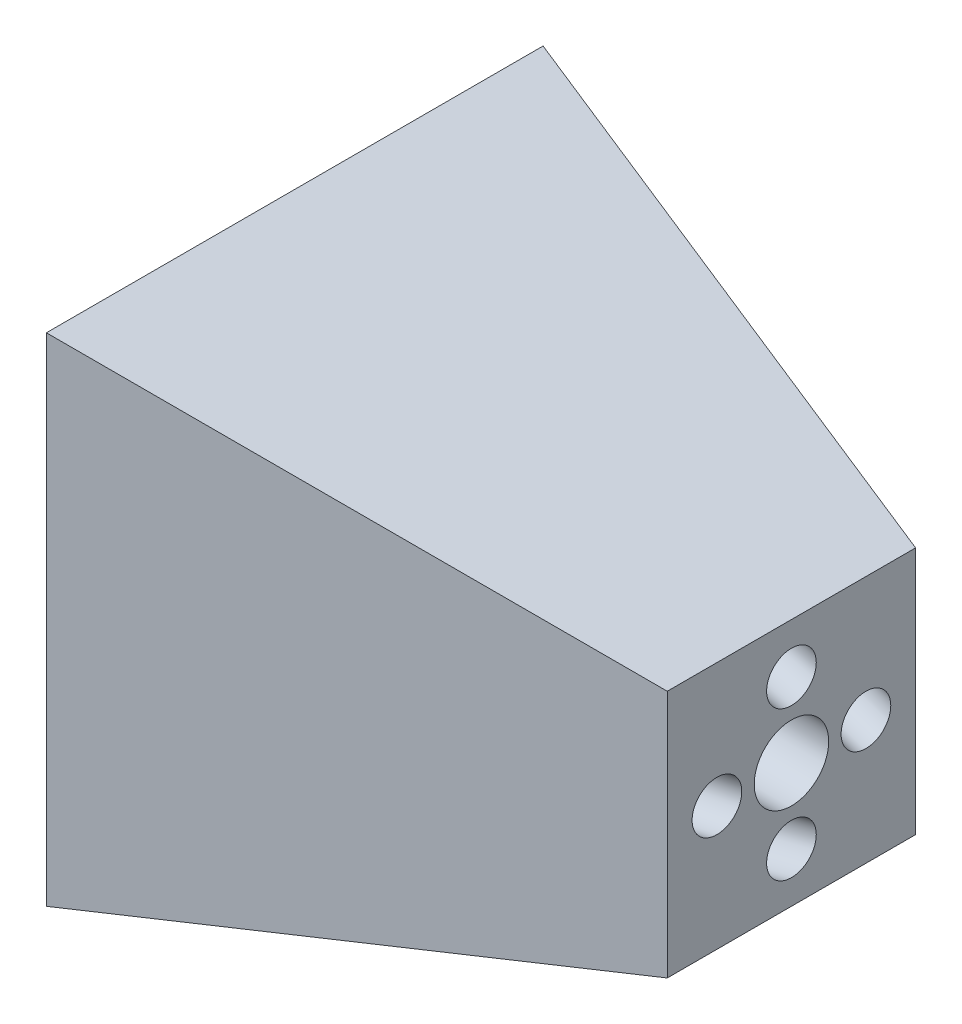
ISO-10303-21;
HEADER;
FILE_DESCRIPTION(('STEP AP214'),'2;1');
FILE_NAME('part.step','',(''),(''),'','','');
FILE_SCHEMA(('AUTOMOTIVE_DESIGN { 1 0 10303 214 1 1 1 1 }'));
ENDSEC;
DATA;
#1=APPLICATION_CONTEXT('core data for automotive mechanical design processes');
#2=APPLICATION_PROTOCOL_DEFINITION('international standard','automotive_design',2000,#1);
#3=PRODUCT_CONTEXT('',#1,'mechanical');
#4=PRODUCT('Part','Part','',(#3));
#5=PRODUCT_RELATED_PRODUCT_CATEGORY('part','',(#4));
#6=PRODUCT_DEFINITION_FORMATION('','',#4);
#7=PRODUCT_DEFINITION_CONTEXT('part definition',#1,'design');
#8=PRODUCT_DEFINITION('design','',#6,#7);
#9=PRODUCT_DEFINITION_SHAPE('','',#8);
#10=(LENGTH_UNIT() NAMED_UNIT(*) SI_UNIT(.MILLI.,.METRE.));
#11=(NAMED_UNIT(*) PLANE_ANGLE_UNIT() SI_UNIT($,.RADIAN.));
#12=(NAMED_UNIT(*) SI_UNIT($,.STERADIAN.) SOLID_ANGLE_UNIT());
#13=UNCERTAINTY_MEASURE_WITH_UNIT(LENGTH_MEASURE(1.E-05),#10,'distance_accuracy_value','');
#14=(GEOMETRIC_REPRESENTATION_CONTEXT(3) GLOBAL_UNCERTAINTY_ASSIGNED_CONTEXT((#13)) GLOBAL_UNIT_ASSIGNED_CONTEXT((#10,
#11,#12)) REPRESENTATION_CONTEXT('',''));
#15=CARTESIAN_POINT('',(0.,0.,0.));
#16=DIRECTION('',(0.,0.,1.));
#17=DIRECTION('',(1.,0.,0.));
#18=AXIS2_PLACEMENT_3D('',#15,#16,#17);
#19=CARTESIAN_POINT('',(-100.,0.,0.));
#20=DIRECTION('',(-1.,0.,0.));
#21=DIRECTION('',(0.,0.,1.));
#22=AXIS2_PLACEMENT_3D('',#19,#20,#21);
#23=PLANE('',#22);
#24=CARTESIAN_POINT('',(-100.,0.,0.));
#25=DIRECTION('',(-1.,0.,0.));
#26=DIRECTION('',(0.,0.,1.));
#27=AXIS2_PLACEMENT_3D('',#24,#25,#26);
#28=CIRCLE('',#27,7.5);
#29=CARTESIAN_POINT('',(-100.,0.,7.5));
#30=VERTEX_POINT('',#29);
#31=EDGE_CURVE('E260',#30,#30,#28,.T.);
#32=ORIENTED_EDGE('',*,*,#31,.F.);
#33=EDGE_LOOP('',(#32));
#34=FACE_BOUND('',#33,.T.);
#35=CARTESIAN_POINT('',(-100.,0.,45.));
#36=CARTESIAN_POINT('',(-100.,0.1385285597722,45.0000003298171));
#37=CARTESIAN_POINT('',(-100.,0.277059840437409,44.9942395939713));
#38=CARTESIAN_POINT('',(-100.,0.553216965321283,44.9712328197263));
#39=CARTESIAN_POINT('',(-100.,0.690842445484033,44.9539824179015));
#40=CARTESIAN_POINT('',(-100.,0.964134984880488,44.9081192702555));
#41=CARTESIAN_POINT('',(-100.,1.09980274929102,44.8795107271996));
#42=CARTESIAN_POINT('',(-100.,1.36834298276902,44.8111165305056));
#43=CARTESIAN_POINT('',(-100.,1.50121442896931,44.7713268607555));
#44=CARTESIAN_POINT('',(-100.,1.76314651576361,44.6808658808765));
#45=CARTESIAN_POINT('',(-100.,1.89220850790448,44.6301984841238));
#46=CARTESIAN_POINT('',(-100.,2.14572590134345,44.5183033445398));
#47=CARTESIAN_POINT('',(-100.,2.27017963256983,44.4570718178089));
#48=CARTESIAN_POINT('',(-100.,2.51352792657697,44.3245078801161));
#49=CARTESIAN_POINT('',(-100.,2.63242446784617,44.2531791010129));
#50=CARTESIAN_POINT('',(-100.,2.86392672172824,44.1008692351718));
#51=CARTESIAN_POINT('',(-100.,2.97653016135156,44.0198846935648));
#52=CARTESIAN_POINT('',(-100.,3.19458281353073,43.8488740810885));
#53=CARTESIAN_POINT('',(-100.,3.30003457819729,43.7588512643216));
#54=CARTESIAN_POINT('',(-100.,3.50313654992574,43.5703275849029));
#55=CARTESIAN_POINT('',(-100.,3.60078394357853,43.4718236912399));
#56=CARTESIAN_POINT('',(-100.,3.78752676708732,43.2670831077228));
#57=CARTESIAN_POINT('',(-100.,3.87662525240749,43.1608492047004));
#58=CARTESIAN_POINT('',(-100.,4.04572511418824,42.9413114512762));
#59=CARTESIAN_POINT('',(-100.,4.12572321439969,42.8280050772916));
#60=CARTESIAN_POINT('',(-100.,4.27600558810493,42.5951815442083));
#61=CARTESIAN_POINT('',(-100.,4.34629333615365,42.4756666278215));
#62=CARTESIAN_POINT('',(-100.,4.47672708609251,42.2311699564561));
#63=CARTESIAN_POINT('',(-100.,4.53686943925657,42.1061862549297));
#64=CARTESIAN_POINT('',(-100.,4.64654636397008,41.8517013366476));
#65=CARTESIAN_POINT('',(-100.,4.69608473333763,41.7222017566435));
#66=CARTESIAN_POINT('',(-100.,4.78425485840752,41.4594898104109));
#67=CARTESIAN_POINT('',(-100.,4.82288269356029,41.3262761284153));
#68=CARTESIAN_POINT('',(-100.,4.88892903017654,41.0571485181558));
#69=CARTESIAN_POINT('',(-100.,4.91635154803485,40.9212355757545));
#70=CARTESIAN_POINT('',(-100.,4.95982657169531,40.6475555997026));
#71=CARTESIAN_POINT('',(-100.,4.97587499349174,40.5097879181601));
#72=CARTESIAN_POINT('',(-100.,4.99646769365315,40.2334356954907));
#73=CARTESIAN_POINT('',(-100.,5.00101609708246,40.0948514651446));
#74=CARTESIAN_POINT('',(-100.,4.99860214578275,39.8177699306864));
#75=CARTESIAN_POINT('',(-100.,4.99163565948307,39.6792726756193));
#76=CARTESIAN_POINT('',(-100.,4.953482728418,39.2654535252476));
#77=CARTESIAN_POINT('',(-100.,4.90506430050006,38.9915124524441));
#78=CARTESIAN_POINT('',(-100.,4.76357583058781,38.4555680393227));
#79=CARTESIAN_POINT('',(-100.,4.6705057885935,38.1935646990047));
#80=CARTESIAN_POINT('',(-100.,4.44228191414584,37.6885353161968));
#81=CARTESIAN_POINT('',(-100.,4.3071280816925,37.4455092737069));
#82=CARTESIAN_POINT('',(-100.,3.99846413140332,36.9851875392002));
#83=CARTESIAN_POINT('',(-100.,3.8249540135675,36.7678918471833));
#84=CARTESIAN_POINT('',(-100.,3.44436319647969,36.3650107092301));
#85=CARTESIAN_POINT('',(-100.,3.2372824972277,36.1794252632938));
#86=CARTESIAN_POINT('',(-100.,2.79526206835773,35.8450869106089));
#87=CARTESIAN_POINT('',(-100.,2.56032233873975,35.6963340038603));
#88=CARTESIAN_POINT('',(-100.,2.06906381021707,35.4397625736148));
#89=CARTESIAN_POINT('',(-100.,1.81274501131237,35.3319440501178));
#90=CARTESIAN_POINT('',(-100.,1.28579796366704,35.1602154257565));
#91=CARTESIAN_POINT('',(-100.,1.01516971492641,35.0963053248923));
#92=CARTESIAN_POINT('',(-100.,0.467068062566414,35.0141562040276));
#93=CARTESIAN_POINT('',(-100.,0.189594658947038,34.9959171840271));
#94=CARTESIAN_POINT('',(-100.,-0.364544209932403,35.0056133003614));
#95=CARTESIAN_POINT('',(-100.,-0.641209675192468,35.0335484366962));
#96=CARTESIAN_POINT('',(-100.,-1.1861018580487,35.1348223717362));
#97=CARTESIAN_POINT('',(-100.,-1.45432857564486,35.2081611704414));
#98=CARTESIAN_POINT('',(-100.,-1.97494520601803,35.3982196478799));
#99=CARTESIAN_POINT('',(-100.,-2.22733511879504,35.5149393266133));
#100=CARTESIAN_POINT('',(-100.,-2.70931688295291,35.7885402764901));
#101=CARTESIAN_POINT('',(-100.,-2.93890873433376,35.9454215476336));
#102=CARTESIAN_POINT('',(-100.,-3.36896192062001,36.2950186839018));
#103=CARTESIAN_POINT('',(-100.,-3.56942325552539,36.4877345490264));
#104=CARTESIAN_POINT('',(-100.,-3.93568641299084,36.903685507934));
#105=CARTESIAN_POINT('',(-100.,-4.10148823555089,37.1269206017169));
#106=CARTESIAN_POINT('',(-100.,-4.39385932887062,37.597752890883));
#107=CARTESIAN_POINT('',(-100.,-4.52042859963029,37.8453500862661));
#108=CARTESIAN_POINT('',(-100.,-4.73084363698725,38.3580775116862));
#109=CARTESIAN_POINT('',(-100.,-4.81468940358454,38.623207741723));
#110=CARTESIAN_POINT('',(-100.,-4.9373448524081,39.163688584712));
#111=CARTESIAN_POINT('',(-100.,-4.97615453463437,39.4390391976641));
#112=CARTESIAN_POINT('',(-100.,-5.00766739131246,39.9923662622781));
#113=CARTESIAN_POINT('',(-100.,-5.00037056576426,40.27034271394));
#114=CARTESIAN_POINT('',(-100.,-4.93987166197812,40.821254489156));
#115=CARTESIAN_POINT('',(-100.,-4.88666958374018,41.0941898127101));
#116=CARTESIAN_POINT('',(-100.,-4.73582756490299,41.6274914001349));
#117=CARTESIAN_POINT('',(-100.,-4.63818762430375,41.8878576640056));
#118=CARTESIAN_POINT('',(-100.,-4.40116290516972,42.3888398943105));
#119=CARTESIAN_POINT('',(-100.,-4.26177812663492,42.6294558607447));
#120=CARTESIAN_POINT('',(-100.,-3.94510821935056,43.0843009160244));
#121=CARTESIAN_POINT('',(-100.,-3.767823090601,43.2985300048699));
#122=CARTESIAN_POINT('',(-100.,-3.38024200036282,43.6946928183599));
#123=CARTESIAN_POINT('',(-100.,-3.16994603887421,43.8766265430045));
#124=CARTESIAN_POINT('',(-100.,-2.72214445377665,44.2031797434365));
#125=CARTESIAN_POINT('',(-100.,-2.4846388301677,44.347799219224));
#126=CARTESIAN_POINT('',(-100.,-1.98896520609138,44.5957384995294));
#127=CARTESIAN_POINT('',(-100.,-1.730797205624,44.6990583040472));
#128=CARTESIAN_POINT('',(-100.,-1.23138937391074,44.8521965812932));
#129=CARTESIAN_POINT('',(-100.,-0.991615447864816,44.9068001624824));
#130=CARTESIAN_POINT('',(-100.,-0.625689194239185,44.9622760170203));
#131=CARTESIAN_POINT('',(-100.,-0.501414470705697,44.9763662784638));
#132=CARTESIAN_POINT('',(-100.,-0.25143000604386,44.9952547298808));
#133=CARTESIAN_POINT('',(-100.,-0.125716123452094,44.9999997006874));
#134=CARTESIAN_POINT('',(-100.,0.,45.));
#135=B_SPLINE_CURVE_WITH_KNOTS('',3,(#35,#36,#37,#38,#39,#40,#41,#42,#43,#44,#45,#46,#47,#48,
#49,#50,#51,#52,#53,#54,#55,#56,#57,#58,#59,#60,#61,#62,#63,#64,#65,#66,#67,#68,#69,#70,#71,#72,
#73,#74,#75,#76,#77,#78,#79,#80,#81,#82,#83,#84,#85,#86,#87,#88,#89,#90,#91,#92,#93,#94,#95,#96,
#97,#98,#99,#100,#101,#102,#103,#104,#105,#106,#107,#108,#109,#110,#111,#112,#113,#114,#115,
#116,#117,#118,#119,#120,#121,#122,#123,#124,#125,#126,#127,#128,#129,#130,#131,#132,#133,#134),
.UNSPECIFIED.,.T.,.F.,(4,2,2,2,2,2,2,2,2,2,2,2,2,2,2,2,2,2,2,2,2,2,2,2,2,2,2,2,2,2,2,2,2,2,2,2,
2,2,2,2,2,2,2,2,2,2,2,2,2,4),(0.,0.415470913561703,0.831099700376821,1.24657483840776,
1.66219940075635,2.07767468763347,2.49329910113596,2.90877439766641,3.32439880151559,
3.73987409870046,4.15549850189521,4.57097379912329,4.98659820227484,5.40207349950566,
5.81769790265447,6.23317319988544,6.64879760303409,7.06427290026508,7.4798973034137,
7.89537260064469,8.31099700379332,9.14137881569243,9.97176062759153,10.8021424394906,
11.6325242513897,12.4629060632888,13.2932878751879,14.1236696870871,14.9540514989862,
15.7844333108853,16.6148151227844,17.4451969346835,18.2755787465826,19.1059605584817,
19.9363423703808,20.7667241822799,21.597105994179,22.4274878060781,23.2578696179772,
24.0882514298763,24.9186332417754,25.7490150536745,26.5793968655736,27.4097786774727,
28.2401604893718,29.0705423012709,29.90092411317,30.6358438530342,31.0107591240888,
31.3878033433167),.UNSPECIFIED.);
#136=CARTESIAN_POINT('',(-100.,0.,45.));
#137=VERTEX_POINT('',#136);
#138=EDGE_CURVE('E264',#137,#137,#135,.T.);
#139=ORIENTED_EDGE('',*,*,#138,.F.);
#140=EDGE_LOOP('',(#139));
#141=FACE_BOUND('',#140,.T.);
#142=CARTESIAN_POINT('',(-100.,40.,-5.));
#143=CARTESIAN_POINT('',(-100.,40.1385285597722,-5.00000032981713));
#144=CARTESIAN_POINT('',(-100.,40.2770598404374,-4.99423959397131));
#145=CARTESIAN_POINT('',(-100.,40.5532169653212,-4.9712328197264));
#146=CARTESIAN_POINT('',(-100.,40.690842445484,-4.95398241790152));
#147=CARTESIAN_POINT('',(-100.,40.9641349848805,-4.90811927025559));
#148=CARTESIAN_POINT('',(-100.,41.099802749291,-4.87951072719967));
#149=CARTESIAN_POINT('',(-100.,41.368342982769,-4.81111653050566));
#150=CARTESIAN_POINT('',(-100.,41.5012144289693,-4.77132686075554));
#151=CARTESIAN_POINT('',(-100.,41.7631465157636,-4.68086588087654));
#152=CARTESIAN_POINT('',(-100.,41.8922085079044,-4.63019848412386));
#153=CARTESIAN_POINT('',(-100.,42.1457259013434,-4.51830334453983));
#154=CARTESIAN_POINT('',(-100.,42.2701796325698,-4.45707181780894));
#155=CARTESIAN_POINT('',(-100.,42.5135279265769,-4.32450788011614));
#156=CARTESIAN_POINT('',(-100.,42.6324244678461,-4.25317910101296));
#157=CARTESIAN_POINT('',(-100.,42.8639267217282,-4.10086923517187));
#158=CARTESIAN_POINT('',(-100.,42.9765301613515,-4.01988469356488));
#159=CARTESIAN_POINT('',(-100.,43.1945828135307,-3.8488740810886));
#160=CARTESIAN_POINT('',(-100.,43.3000345781973,-3.75885126432164));
#161=CARTESIAN_POINT('',(-100.,43.5031365499257,-3.57032758490301));
#162=CARTESIAN_POINT('',(-100.,43.6007839435785,-3.47182369123994));
#163=CARTESIAN_POINT('',(-100.,43.7875267670873,-3.26708310772287));
#164=CARTESIAN_POINT('',(-100.,43.8766252524075,-3.16084920470046));
#165=CARTESIAN_POINT('',(-100.,44.0457251141882,-2.94131145127629));
#166=CARTESIAN_POINT('',(-100.,44.1257232143996,-2.82800507729169));
#167=CARTESIAN_POINT('',(-100.,44.2760055881049,-2.59518154420832));
#168=CARTESIAN_POINT('',(-100.,44.3462933361536,-2.47566662782151));
#169=CARTESIAN_POINT('',(-100.,44.4767270860925,-2.23116995645621));
#170=CARTESIAN_POINT('',(-100.,44.5368694392565,-2.10618625492972));
#171=CARTESIAN_POINT('',(-100.,44.6465463639701,-1.85170133664761));
#172=CARTESIAN_POINT('',(-100.,44.6960847333376,-1.72220175664351));
#173=CARTESIAN_POINT('',(-100.,44.7842548584075,-1.45948981041093));
#174=CARTESIAN_POINT('',(-100.,44.8228826935603,-1.32627612841536));
#175=CARTESIAN_POINT('',(-100.,44.8889290301765,-1.05714851815584));
#176=CARTESIAN_POINT('',(-100.,44.9163515480348,-0.921235575754509));
#177=CARTESIAN_POINT('',(-100.,44.9598265716953,-0.647555599702657));
#178=CARTESIAN_POINT('',(-100.,44.9758749934917,-0.509787918160154));
#179=CARTESIAN_POINT('',(-100.,44.9964676936531,-0.233435695490788));
#180=CARTESIAN_POINT('',(-100.,45.0010160970824,-0.0948514651446767));
#181=CARTESIAN_POINT('',(-100.,44.9986021457827,0.182230069313564));
#182=CARTESIAN_POINT('',(-100.,44.991635659483,0.320727324380607));
#183=CARTESIAN_POINT('',(-100.,44.953482728418,0.734546474752395));
#184=CARTESIAN_POINT('',(-100.,44.9050643005,1.00848754755585));
#185=CARTESIAN_POINT('',(-100.,44.7635758305878,1.54443196067729));
#186=CARTESIAN_POINT('',(-100.,44.6705057885935,1.80643530099526));
#187=CARTESIAN_POINT('',(-100.,44.4422819141458,2.31146468380314));
#188=CARTESIAN_POINT('',(-100.,44.3071280816925,2.55449072629304));
#189=CARTESIAN_POINT('',(-100.,43.9984641314033,3.01481246079979));
#190=CARTESIAN_POINT('',(-100.,43.8249540135675,3.23210815281664));
#191=CARTESIAN_POINT('',(-100.,43.4443631964797,3.63498929076985));
#192=CARTESIAN_POINT('',(-100.,43.2372824972277,3.8205747367062));
#193=CARTESIAN_POINT('',(-100.,42.7952620683577,4.15491308939109));
#194=CARTESIAN_POINT('',(-100.,42.5603223387397,4.30366599613963));
#195=CARTESIAN_POINT('',(-100.,42.069063810217,4.56023742638518));
#196=CARTESIAN_POINT('',(-100.,41.8127450113123,4.6680559498822));
#197=CARTESIAN_POINT('',(-100.,41.285797963667,4.83978457424346));
#198=CARTESIAN_POINT('',(-100.,41.0151697149264,4.90369467510771));
#199=CARTESIAN_POINT('',(-100.,40.4670680625664,4.9858437959724));
#200=CARTESIAN_POINT('',(-100.,40.189594658947,5.00408281597285));
#201=CARTESIAN_POINT('',(-100.,39.6354557900676,4.99438669963854));
#202=CARTESIAN_POINT('',(-100.,39.3587903248075,4.96645156330379));
#203=CARTESIAN_POINT('',(-100.,38.8138981419513,4.8651776282638));
#204=CARTESIAN_POINT('',(-100.,38.5456714243551,4.79183882955856));
#205=CARTESIAN_POINT('',(-100.,38.0250547939819,4.60178035212001));
#206=CARTESIAN_POINT('',(-100.,37.7726648812049,4.4850606733867));
#207=CARTESIAN_POINT('',(-100.,37.290683117047,4.21145972350986));
#208=CARTESIAN_POINT('',(-100.,37.0610912656662,4.05457845236633));
#209=CARTESIAN_POINT('',(-100.,36.6310380793799,3.70498131609816));
#210=CARTESIAN_POINT('',(-100.,36.4305767444746,3.51226545097352));
#211=CARTESIAN_POINT('',(-100.,36.0643135870091,3.09631449206596));
#212=CARTESIAN_POINT('',(-100.,35.8985117644491,2.87307939828305));
#213=CARTESIAN_POINT('',(-100.,35.6061406711293,2.40224710911697));
#214=CARTESIAN_POINT('',(-100.,35.4795714003697,2.1546499137338));
#215=CARTESIAN_POINT('',(-100.,35.2691563630127,1.64192248831377));
#216=CARTESIAN_POINT('',(-100.,35.1853105964154,1.3767922582769));
#217=CARTESIAN_POINT('',(-100.,35.0626551475919,0.836311415287918));
#218=CARTESIAN_POINT('',(-100.,35.0238454653656,0.560960802335802));
#219=CARTESIAN_POINT('',(-100.,34.9923326086875,0.00763373772181723));
#220=CARTESIAN_POINT('',(-100.,34.9996294342357,-0.270342713940052));
#221=CARTESIAN_POINT('',(-100.,35.0601283380218,-0.821254489156051));
#222=CARTESIAN_POINT('',(-100.,35.1133304162598,-1.09418981271018));
#223=CARTESIAN_POINT('',(-100.,35.264172435097,-1.62749140013499));
#224=CARTESIAN_POINT('',(-100.,35.3618123756962,-1.88785766400568));
#225=CARTESIAN_POINT('',(-100.,35.5988370948303,-2.3888398943106));
#226=CARTESIAN_POINT('',(-100.,35.7382218733651,-2.62945586074483));
#227=CARTESIAN_POINT('',(-100.,36.0548917806494,-3.08430091602454));
#228=CARTESIAN_POINT('',(-100.,36.232176909399,-3.29853000487001));
#229=CARTESIAN_POINT('',(-100.,36.6197579996372,-3.69469281836002));
#230=CARTESIAN_POINT('',(-100.,36.8300539611258,-3.87662654300457));
#231=CARTESIAN_POINT('',(-100.,37.2778555462234,-4.20317974343661));
#232=CARTESIAN_POINT('',(-100.,37.5153611698323,-4.34779921922412));
#233=CARTESIAN_POINT('',(-100.,38.0110347939087,-4.59573849952943));
#234=CARTESIAN_POINT('',(-100.,38.269202794376,-4.69905830404724));
#235=CARTESIAN_POINT('',(-100.,38.7686106260893,-4.8521965812933));
#236=CARTESIAN_POINT('',(-100.,39.0083845521352,-4.90680016248247));
#237=CARTESIAN_POINT('',(-100.,39.3743108057608,-4.96227601702033));
#238=CARTESIAN_POINT('',(-100.,39.4985855292943,-4.97636627846384));
#239=CARTESIAN_POINT('',(-100.,39.7485699939561,-4.99525472988085));
#240=CARTESIAN_POINT('',(-100.,39.8742838765479,-4.99999970068749));
#241=CARTESIAN_POINT('',(-100.,40.,-5.));
#242=B_SPLINE_CURVE_WITH_KNOTS('',3,(#142,#143,#144,#145,#146,#147,#148,#149,#150,#151,#152,
#153,#154,#155,#156,#157,#158,#159,#160,#161,#162,#163,#164,#165,#166,#167,#168,#169,#170,#171,
#172,#173,#174,#175,#176,#177,#178,#179,#180,#181,#182,#183,#184,#185,#186,#187,#188,#189,#190,
#191,#192,#193,#194,#195,#196,#197,#198,#199,#200,#201,#202,#203,#204,#205,#206,#207,#208,#209,
#210,#211,#212,#213,#214,#215,#216,#217,#218,#219,#220,#221,#222,#223,#224,#225,#226,#227,#228,
#229,#230,#231,#232,#233,#234,#235,#236,#237,#238,#239,#240,#241),.UNSPECIFIED.,.T.,.F.,(4,2,2,
2,2,2,2,2,2,2,2,2,2,2,2,2,2,2,2,2,2,2,2,2,2,2,2,2,2,2,2,2,2,2,2,2,2,2,2,2,2,2,2,2,2,2,2,2,2,4),
(0.,0.415470913561702,0.831099700376814,1.24657483840776,1.66219940075633,2.07767468763346,
2.49329910113595,2.9087743976664,3.32439880151558,3.73987409870045,4.15549850189521,
4.57097379912328,4.98659820227483,5.40207349950565,5.81769790265446,6.23317319988543,
6.64879760303408,7.06427290026507,7.4798973034137,7.89537260064469,8.31099700379332,
9.14137881569243,9.97176062759154,10.8021424394906,11.6325242513898,12.4629060632889,
13.293287875188,14.1236696870871,14.9540514989862,15.7844333108853,16.6148151227844,
17.4451969346835,18.2755787465826,19.1059605584817,19.9363423703808,20.7667241822799,
21.597105994179,22.4274878060781,23.2578696179773,24.0882514298764,24.9186332417755,
25.7490150536746,26.5793968655737,27.4097786774728,28.2401604893719,29.070542301271,
29.9009241131701,30.6358438530342,31.0107591240888,31.3878033433167),.UNSPECIFIED.);
#243=CARTESIAN_POINT('',(-100.,40.,-5.));
#244=VERTEX_POINT('',#243);
#245=EDGE_CURVE('E268',#244,#244,#242,.T.);
#246=ORIENTED_EDGE('',*,*,#245,.T.);
#247=EDGE_LOOP('',(#246));
#248=FACE_BOUND('',#247,.T.);
#249=CARTESIAN_POINT('',(-100.,0.,-45.));
#250=CARTESIAN_POINT('',(-100.,0.1385285597722,-45.0000003298171));
#251=CARTESIAN_POINT('',(-100.,0.277059840437409,-44.9942395939713));
#252=CARTESIAN_POINT('',(-100.,0.553216965321283,-44.9712328197263));
#253=CARTESIAN_POINT('',(-100.,0.690842445484033,-44.9539824179015));
#254=CARTESIAN_POINT('',(-100.,0.964134984880488,-44.9081192702555));
#255=CARTESIAN_POINT('',(-100.,1.09980274929102,-44.8795107271996));
#256=CARTESIAN_POINT('',(-100.,1.36834298276902,-44.8111165305056));
#257=CARTESIAN_POINT('',(-100.,1.50121442896931,-44.7713268607555));
#258=CARTESIAN_POINT('',(-100.,1.76314651576361,-44.6808658808765));
#259=CARTESIAN_POINT('',(-100.,1.89220850790448,-44.6301984841238));
#260=CARTESIAN_POINT('',(-100.,2.14572590134345,-44.5183033445398));
#261=CARTESIAN_POINT('',(-100.,2.27017963256983,-44.4570718178089));
#262=CARTESIAN_POINT('',(-100.,2.51352792657697,-44.3245078801161));
#263=CARTESIAN_POINT('',(-100.,2.63242446784617,-44.2531791010129));
#264=CARTESIAN_POINT('',(-100.,2.86392672172824,-44.1008692351718));
#265=CARTESIAN_POINT('',(-100.,2.97653016135156,-44.0198846935648));
#266=CARTESIAN_POINT('',(-100.,3.19458281353073,-43.8488740810885));
#267=CARTESIAN_POINT('',(-100.,3.30003457819729,-43.7588512643216));
#268=CARTESIAN_POINT('',(-100.,3.50313654992574,-43.5703275849029));
#269=CARTESIAN_POINT('',(-100.,3.60078394357853,-43.4718236912399));
#270=CARTESIAN_POINT('',(-100.,3.78752676708732,-43.2670831077228));
#271=CARTESIAN_POINT('',(-100.,3.87662525240749,-43.1608492047004));
#272=CARTESIAN_POINT('',(-100.,4.04572511418824,-42.9413114512762));
#273=CARTESIAN_POINT('',(-100.,4.12572321439969,-42.8280050772916));
#274=CARTESIAN_POINT('',(-100.,4.27600558810493,-42.5951815442083));
#275=CARTESIAN_POINT('',(-100.,4.34629333615365,-42.4756666278215));
#276=CARTESIAN_POINT('',(-100.,4.47672708609251,-42.2311699564561));
#277=CARTESIAN_POINT('',(-100.,4.53686943925657,-42.1061862549297));
#278=CARTESIAN_POINT('',(-100.,4.64654636397008,-41.8517013366476));
#279=CARTESIAN_POINT('',(-100.,4.69608473333763,-41.7222017566435));
#280=CARTESIAN_POINT('',(-100.,4.78425485840752,-41.4594898104109));
#281=CARTESIAN_POINT('',(-100.,4.82288269356029,-41.3262761284153));
#282=CARTESIAN_POINT('',(-100.,4.88892903017654,-41.0571485181558));
#283=CARTESIAN_POINT('',(-100.,4.91635154803485,-40.9212355757545));
#284=CARTESIAN_POINT('',(-100.,4.95982657169531,-40.6475555997026));
#285=CARTESIAN_POINT('',(-100.,4.97587499349174,-40.5097879181601));
#286=CARTESIAN_POINT('',(-100.,4.99646769365315,-40.2334356954907));
#287=CARTESIAN_POINT('',(-100.,5.00101609708246,-40.0948514651446));
#288=CARTESIAN_POINT('',(-100.,4.99860214578275,-39.8177699306864));
#289=CARTESIAN_POINT('',(-100.,4.99163565948307,-39.6792726756193));
#290=CARTESIAN_POINT('',(-100.,4.953482728418,-39.2654535252476));
#291=CARTESIAN_POINT('',(-100.,4.90506430050006,-38.9915124524441));
#292=CARTESIAN_POINT('',(-100.,4.76357583058781,-38.4555680393227));
#293=CARTESIAN_POINT('',(-100.,4.6705057885935,-38.1935646990047));
#294=CARTESIAN_POINT('',(-100.,4.44228191414584,-37.6885353161968));
#295=CARTESIAN_POINT('',(-100.,4.3071280816925,-37.4455092737069));
#296=CARTESIAN_POINT('',(-100.,3.99846413140332,-36.9851875392002));
#297=CARTESIAN_POINT('',(-100.,3.8249540135675,-36.7678918471833));
#298=CARTESIAN_POINT('',(-100.,3.44436319647969,-36.3650107092301));
#299=CARTESIAN_POINT('',(-100.,3.2372824972277,-36.1794252632938));
#300=CARTESIAN_POINT('',(-100.,2.79526206835773,-35.8450869106089));
#301=CARTESIAN_POINT('',(-100.,2.56032233873975,-35.6963340038603));
#302=CARTESIAN_POINT('',(-100.,2.06906381021707,-35.4397625736148));
#303=CARTESIAN_POINT('',(-100.,1.81274501131237,-35.3319440501178));
#304=CARTESIAN_POINT('',(-100.,1.28579796366704,-35.1602154257565));
#305=CARTESIAN_POINT('',(-100.,1.01516971492641,-35.0963053248923));
#306=CARTESIAN_POINT('',(-100.,0.467068062566414,-35.0141562040276));
#307=CARTESIAN_POINT('',(-100.,0.189594658947038,-34.9959171840271));
#308=CARTESIAN_POINT('',(-100.,-0.364544209932403,-35.0056133003614));
#309=CARTESIAN_POINT('',(-100.,-0.641209675192468,-35.0335484366962));
#310=CARTESIAN_POINT('',(-100.,-1.1861018580487,-35.1348223717362));
#311=CARTESIAN_POINT('',(-100.,-1.45432857564486,-35.2081611704414));
#312=CARTESIAN_POINT('',(-100.,-1.97494520601803,-35.3982196478799));
#313=CARTESIAN_POINT('',(-100.,-2.22733511879504,-35.5149393266133));
#314=CARTESIAN_POINT('',(-100.,-2.70931688295291,-35.7885402764901));
#315=CARTESIAN_POINT('',(-100.,-2.93890873433376,-35.9454215476336));
#316=CARTESIAN_POINT('',(-100.,-3.36896192062001,-36.2950186839018));
#317=CARTESIAN_POINT('',(-100.,-3.56942325552539,-36.4877345490264));
#318=CARTESIAN_POINT('',(-100.,-3.93568641299084,-36.903685507934));
#319=CARTESIAN_POINT('',(-100.,-4.10148823555089,-37.1269206017169));
#320=CARTESIAN_POINT('',(-100.,-4.39385932887062,-37.597752890883));
#321=CARTESIAN_POINT('',(-100.,-4.52042859963029,-37.8453500862661));
#322=CARTESIAN_POINT('',(-100.,-4.73084363698725,-38.3580775116862));
#323=CARTESIAN_POINT('',(-100.,-4.81468940358454,-38.623207741723));
#324=CARTESIAN_POINT('',(-100.,-4.9373448524081,-39.163688584712));
#325=CARTESIAN_POINT('',(-100.,-4.97615453463437,-39.4390391976641));
#326=CARTESIAN_POINT('',(-100.,-5.00766739131246,-39.9923662622781));
#327=CARTESIAN_POINT('',(-100.,-5.00037056576426,-40.27034271394));
#328=CARTESIAN_POINT('',(-100.,-4.93987166197812,-40.821254489156));
#329=CARTESIAN_POINT('',(-100.,-4.88666958374018,-41.0941898127101));
#330=CARTESIAN_POINT('',(-100.,-4.73582756490299,-41.6274914001349));
#331=CARTESIAN_POINT('',(-100.,-4.63818762430375,-41.8878576640056));
#332=CARTESIAN_POINT('',(-100.,-4.40116290516972,-42.3888398943105));
#333=CARTESIAN_POINT('',(-100.,-4.26177812663492,-42.6294558607447));
#334=CARTESIAN_POINT('',(-100.,-3.94510821935056,-43.0843009160244));
#335=CARTESIAN_POINT('',(-100.,-3.767823090601,-43.2985300048699));
#336=CARTESIAN_POINT('',(-100.,-3.38024200036282,-43.6946928183599));
#337=CARTESIAN_POINT('',(-100.,-3.16994603887421,-43.8766265430045));
#338=CARTESIAN_POINT('',(-100.,-2.72214445377665,-44.2031797434365));
#339=CARTESIAN_POINT('',(-100.,-2.4846388301677,-44.347799219224));
#340=CARTESIAN_POINT('',(-100.,-1.98896520609138,-44.5957384995294));
#341=CARTESIAN_POINT('',(-100.,-1.730797205624,-44.6990583040472));
#342=CARTESIAN_POINT('',(-100.,-1.23138937391074,-44.8521965812932));
#343=CARTESIAN_POINT('',(-100.,-0.991615447864816,-44.9068001624824));
#344=CARTESIAN_POINT('',(-100.,-0.625689194239185,-44.9622760170203));
#345=CARTESIAN_POINT('',(-100.,-0.501414470705697,-44.9763662784638));
#346=CARTESIAN_POINT('',(-100.,-0.25143000604386,-44.9952547298808));
#347=CARTESIAN_POINT('',(-100.,-0.125716123452094,-44.9999997006874));
#348=CARTESIAN_POINT('',(-100.,0.,-45.));
#349=B_SPLINE_CURVE_WITH_KNOTS('',3,(#249,#250,#251,#252,#253,#254,#255,#256,#257,#258,#259,
#260,#261,#262,#263,#264,#265,#266,#267,#268,#269,#270,#271,#272,#273,#274,#275,#276,#277,#278,
#279,#280,#281,#282,#283,#284,#285,#286,#287,#288,#289,#290,#291,#292,#293,#294,#295,#296,#297,
#298,#299,#300,#301,#302,#303,#304,#305,#306,#307,#308,#309,#310,#311,#312,#313,#314,#315,#316,
#317,#318,#319,#320,#321,#322,#323,#324,#325,#326,#327,#328,#329,#330,#331,#332,#333,#334,#335,
#336,#337,#338,#339,#340,#341,#342,#343,#344,#345,#346,#347,#348),.UNSPECIFIED.,.T.,.F.,(4,2,2,
2,2,2,2,2,2,2,2,2,2,2,2,2,2,2,2,2,2,2,2,2,2,2,2,2,2,2,2,2,2,2,2,2,2,2,2,2,2,2,2,2,2,2,2,2,2,4),
(0.,0.415470913561703,0.831099700376821,1.24657483840776,1.66219940075635,2.07767468763347,
2.49329910113596,2.90877439766641,3.32439880151559,3.73987409870046,4.15549850189521,
4.57097379912329,4.98659820227484,5.40207349950566,5.81769790265447,6.23317319988544,
6.64879760303409,7.06427290026508,7.4798973034137,7.89537260064469,8.31099700379332,
9.14137881569243,9.97176062759153,10.8021424394906,11.6325242513897,12.4629060632888,
13.2932878751879,14.1236696870871,14.9540514989862,15.7844333108853,16.6148151227844,
17.4451969346835,18.2755787465826,19.1059605584817,19.9363423703808,20.7667241822799,
21.597105994179,22.4274878060781,23.2578696179772,24.0882514298763,24.9186332417754,
25.7490150536745,26.5793968655736,27.4097786774727,28.2401604893718,29.0705423012709,
29.90092411317,30.6358438530342,31.0107591240888,31.3878033433167),.UNSPECIFIED.);
#350=CARTESIAN_POINT('',(-100.,0.,-45.));
#351=VERTEX_POINT('',#350);
#352=EDGE_CURVE('E115',#351,#351,#349,.T.);
#353=ORIENTED_EDGE('',*,*,#352,.T.);
#354=EDGE_LOOP('',(#353));
#355=FACE_BOUND('',#354,.T.);
#356=DIRECTION('',(0.,-1.,0.));
#357=VECTOR('',#356,1.);
#358=CARTESIAN_POINT('',(-100.,50.,50.));
#359=LINE('',#358,#357);
#360=CARTESIAN_POINT('',(-100.,50.,50.));
#361=VERTEX_POINT('',#360);
#362=CARTESIAN_POINT('',(-100.,-50.,50.));
#363=VERTEX_POINT('',#362);
#364=EDGE_CURVE('E94',#361,#363,#359,.T.);
#365=ORIENTED_EDGE('',*,*,#364,.F.);
#366=DIRECTION('',(0.,0.,1.));
#367=VECTOR('',#366,1.);
#368=CARTESIAN_POINT('',(-100.,50.,-50.));
#369=LINE('',#368,#367);
#370=CARTESIAN_POINT('',(-100.,50.,-50.));
#371=VERTEX_POINT('',#370);
#372=EDGE_CURVE('E84',#371,#361,#369,.T.);
#373=ORIENTED_EDGE('',*,*,#372,.F.);
#374=DIRECTION('',(0.,1.,0.));
#375=VECTOR('',#374,1.);
#376=CARTESIAN_POINT('',(-100.,50.,-50.));
#377=LINE('',#376,#375);
#378=CARTESIAN_POINT('',(-100.,-50.,-50.));
#379=VERTEX_POINT('',#378);
#380=EDGE_CURVE('E107',#379,#371,#377,.T.);
#381=ORIENTED_EDGE('',*,*,#380,.F.);
#382=DIRECTION('',(0.,0.,-1.));
#383=VECTOR('',#382,1.);
#384=CARTESIAN_POINT('',(-100.,-50.,-50.));
#385=LINE('',#384,#383);
#386=EDGE_CURVE('E113',#363,#379,#385,.T.);
#387=ORIENTED_EDGE('',*,*,#386,.F.);
#388=EDGE_LOOP('',(#365,#373,#381,#387));
#389=FACE_BOUND('',#388,.T.);
#390=CARTESIAN_POINT('',(-100.,-40.,-5.));
#391=CARTESIAN_POINT('',(-100.,-40.1385285597722,-5.00000032981713));
#392=CARTESIAN_POINT('',(-100.,-40.2770598404374,-4.99423959397131));
#393=CARTESIAN_POINT('',(-100.,-40.5532169653212,-4.9712328197264));
#394=CARTESIAN_POINT('',(-100.,-40.690842445484,-4.95398241790152));
#395=CARTESIAN_POINT('',(-100.,-40.9641349848805,-4.90811927025559));
#396=CARTESIAN_POINT('',(-100.,-41.099802749291,-4.87951072719967));
#397=CARTESIAN_POINT('',(-100.,-41.368342982769,-4.81111653050566));
#398=CARTESIAN_POINT('',(-100.,-41.5012144289693,-4.77132686075554));
#399=CARTESIAN_POINT('',(-100.,-41.7631465157636,-4.68086588087654));
#400=CARTESIAN_POINT('',(-100.,-41.8922085079044,-4.63019848412386));
#401=CARTESIAN_POINT('',(-100.,-42.1457259013434,-4.51830334453983));
#402=CARTESIAN_POINT('',(-100.,-42.2701796325698,-4.45707181780894));
#403=CARTESIAN_POINT('',(-100.,-42.5135279265769,-4.32450788011614));
#404=CARTESIAN_POINT('',(-100.,-42.6324244678461,-4.25317910101296));
#405=CARTESIAN_POINT('',(-100.,-42.8639267217282,-4.10086923517187));
#406=CARTESIAN_POINT('',(-100.,-42.9765301613515,-4.01988469356488));
#407=CARTESIAN_POINT('',(-100.,-43.1945828135307,-3.8488740810886));
#408=CARTESIAN_POINT('',(-100.,-43.3000345781973,-3.75885126432164));
#409=CARTESIAN_POINT('',(-100.,-43.5031365499257,-3.57032758490301));
#410=CARTESIAN_POINT('',(-100.,-43.6007839435785,-3.47182369123994));
#411=CARTESIAN_POINT('',(-100.,-43.7875267670873,-3.26708310772287));
#412=CARTESIAN_POINT('',(-100.,-43.8766252524075,-3.16084920470046));
#413=CARTESIAN_POINT('',(-100.,-44.0457251141882,-2.94131145127629));
#414=CARTESIAN_POINT('',(-100.,-44.1257232143996,-2.82800507729169));
#415=CARTESIAN_POINT('',(-100.,-44.2760055881049,-2.59518154420832));
#416=CARTESIAN_POINT('',(-100.,-44.3462933361536,-2.47566662782151));
#417=CARTESIAN_POINT('',(-100.,-44.4767270860925,-2.23116995645621));
#418=CARTESIAN_POINT('',(-100.,-44.5368694392565,-2.10618625492972));
#419=CARTESIAN_POINT('',(-100.,-44.6465463639701,-1.85170133664761));
#420=CARTESIAN_POINT('',(-100.,-44.6960847333376,-1.72220175664351));
#421=CARTESIAN_POINT('',(-100.,-44.7842548584075,-1.45948981041093));
#422=CARTESIAN_POINT('',(-100.,-44.8228826935603,-1.32627612841536));
#423=CARTESIAN_POINT('',(-100.,-44.8889290301765,-1.05714851815584));
#424=CARTESIAN_POINT('',(-100.,-44.9163515480348,-0.921235575754509));
#425=CARTESIAN_POINT('',(-100.,-44.9598265716953,-0.647555599702657));
#426=CARTESIAN_POINT('',(-100.,-44.9758749934917,-0.509787918160154));
#427=CARTESIAN_POINT('',(-100.,-44.9964676936531,-0.233435695490788));
#428=CARTESIAN_POINT('',(-100.,-45.0010160970824,-0.0948514651446767));
#429=CARTESIAN_POINT('',(-100.,-44.9986021457827,0.182230069313564));
#430=CARTESIAN_POINT('',(-100.,-44.991635659483,0.320727324380607));
#431=CARTESIAN_POINT('',(-100.,-44.953482728418,0.734546474752395));
#432=CARTESIAN_POINT('',(-100.,-44.9050643005,1.00848754755585));
#433=CARTESIAN_POINT('',(-100.,-44.7635758305878,1.54443196067729));
#434=CARTESIAN_POINT('',(-100.,-44.6705057885935,1.80643530099526));
#435=CARTESIAN_POINT('',(-100.,-44.4422819141458,2.31146468380314));
#436=CARTESIAN_POINT('',(-100.,-44.3071280816925,2.55449072629304));
#437=CARTESIAN_POINT('',(-100.,-43.9984641314033,3.01481246079979));
#438=CARTESIAN_POINT('',(-100.,-43.8249540135675,3.23210815281664));
#439=CARTESIAN_POINT('',(-100.,-43.4443631964797,3.63498929076985));
#440=CARTESIAN_POINT('',(-100.,-43.2372824972277,3.8205747367062));
#441=CARTESIAN_POINT('',(-100.,-42.7952620683577,4.15491308939109));
#442=CARTESIAN_POINT('',(-100.,-42.5603223387397,4.30366599613963));
#443=CARTESIAN_POINT('',(-100.,-42.069063810217,4.56023742638518));
#444=CARTESIAN_POINT('',(-100.,-41.8127450113123,4.6680559498822));
#445=CARTESIAN_POINT('',(-100.,-41.285797963667,4.83978457424346));
#446=CARTESIAN_POINT('',(-100.,-41.0151697149264,4.90369467510771));
#447=CARTESIAN_POINT('',(-100.,-40.4670680625664,4.9858437959724));
#448=CARTESIAN_POINT('',(-100.,-40.189594658947,5.00408281597285));
#449=CARTESIAN_POINT('',(-100.,-39.6354557900676,4.99438669963854));
#450=CARTESIAN_POINT('',(-100.,-39.3587903248075,4.96645156330379));
#451=CARTESIAN_POINT('',(-100.,-38.8138981419513,4.8651776282638));
#452=CARTESIAN_POINT('',(-100.,-38.5456714243551,4.79183882955856));
#453=CARTESIAN_POINT('',(-100.,-38.0250547939819,4.60178035212001));
#454=CARTESIAN_POINT('',(-100.,-37.7726648812049,4.4850606733867));
#455=CARTESIAN_POINT('',(-100.,-37.290683117047,4.21145972350986));
#456=CARTESIAN_POINT('',(-100.,-37.0610912656662,4.05457845236633));
#457=CARTESIAN_POINT('',(-100.,-36.6310380793799,3.70498131609816));
#458=CARTESIAN_POINT('',(-100.,-36.4305767444746,3.51226545097352));
#459=CARTESIAN_POINT('',(-100.,-36.0643135870091,3.09631449206596));
#460=CARTESIAN_POINT('',(-100.,-35.8985117644491,2.87307939828305));
#461=CARTESIAN_POINT('',(-100.,-35.6061406711293,2.40224710911697));
#462=CARTESIAN_POINT('',(-100.,-35.4795714003697,2.1546499137338));
#463=CARTESIAN_POINT('',(-100.,-35.2691563630127,1.64192248831377));
#464=CARTESIAN_POINT('',(-100.,-35.1853105964154,1.3767922582769));
#465=CARTESIAN_POINT('',(-100.,-35.0626551475919,0.836311415287918));
#466=CARTESIAN_POINT('',(-100.,-35.0238454653656,0.560960802335802));
#467=CARTESIAN_POINT('',(-100.,-34.9923326086875,0.00763373772181723));
#468=CARTESIAN_POINT('',(-100.,-34.9996294342357,-0.270342713940052));
#469=CARTESIAN_POINT('',(-100.,-35.0601283380218,-0.821254489156051));
#470=CARTESIAN_POINT('',(-100.,-35.1133304162598,-1.09418981271018));
#471=CARTESIAN_POINT('',(-100.,-35.264172435097,-1.62749140013499));
#472=CARTESIAN_POINT('',(-100.,-35.3618123756962,-1.88785766400568));
#473=CARTESIAN_POINT('',(-100.,-35.5988370948303,-2.3888398943106));
#474=CARTESIAN_POINT('',(-100.,-35.7382218733651,-2.62945586074483));
#475=CARTESIAN_POINT('',(-100.,-36.0548917806494,-3.08430091602454));
#476=CARTESIAN_POINT('',(-100.,-36.232176909399,-3.29853000487001));
#477=CARTESIAN_POINT('',(-100.,-36.6197579996372,-3.69469281836002));
#478=CARTESIAN_POINT('',(-100.,-36.8300539611258,-3.87662654300457));
#479=CARTESIAN_POINT('',(-100.,-37.2778555462234,-4.20317974343661));
#480=CARTESIAN_POINT('',(-100.,-37.5153611698323,-4.34779921922412));
#481=CARTESIAN_POINT('',(-100.,-38.0110347939087,-4.59573849952943));
#482=CARTESIAN_POINT('',(-100.,-38.269202794376,-4.69905830404724));
#483=CARTESIAN_POINT('',(-100.,-38.7686106260893,-4.8521965812933));
#484=CARTESIAN_POINT('',(-100.,-39.0083845521352,-4.90680016248247));
#485=CARTESIAN_POINT('',(-100.,-39.3743108057608,-4.96227601702033));
#486=CARTESIAN_POINT('',(-100.,-39.4985855292943,-4.97636627846384));
#487=CARTESIAN_POINT('',(-100.,-39.7485699939561,-4.99525472988085));
#488=CARTESIAN_POINT('',(-100.,-39.8742838765479,-4.99999970068749));
#489=CARTESIAN_POINT('',(-100.,-40.,-5.));
#490=B_SPLINE_CURVE_WITH_KNOTS('',3,(#390,#391,#392,#393,#394,#395,#396,#397,#398,#399,#400,
#401,#402,#403,#404,#405,#406,#407,#408,#409,#410,#411,#412,#413,#414,#415,#416,#417,#418,#419,
#420,#421,#422,#423,#424,#425,#426,#427,#428,#429,#430,#431,#432,#433,#434,#435,#436,#437,#438,
#439,#440,#441,#442,#443,#444,#445,#446,#447,#448,#449,#450,#451,#452,#453,#454,#455,#456,#457,
#458,#459,#460,#461,#462,#463,#464,#465,#466,#467,#468,#469,#470,#471,#472,#473,#474,#475,#476,
#477,#478,#479,#480,#481,#482,#483,#484,#485,#486,#487,#488,#489),.UNSPECIFIED.,.T.,.F.,(4,2,2,
2,2,2,2,2,2,2,2,2,2,2,2,2,2,2,2,2,2,2,2,2,2,2,2,2,2,2,2,2,2,2,2,2,2,2,2,2,2,2,2,2,2,2,2,2,2,4),
(0.,0.415470913561702,0.831099700376814,1.24657483840776,1.66219940075633,2.07767468763346,
2.49329910113595,2.9087743976664,3.32439880151558,3.73987409870045,4.15549850189521,
4.57097379912328,4.98659820227483,5.40207349950565,5.81769790265446,6.23317319988543,
6.64879760303408,7.06427290026507,7.4798973034137,7.89537260064469,8.31099700379332,
9.14137881569243,9.97176062759154,10.8021424394906,11.6325242513898,12.4629060632889,
13.293287875188,14.1236696870871,14.9540514989862,15.7844333108853,16.6148151227844,
17.4451969346835,18.2755787465826,19.1059605584817,19.9363423703808,20.7667241822799,
21.597105994179,22.4274878060781,23.2578696179773,24.0882514298764,24.9186332417755,
25.7490150536746,26.5793968655737,27.4097786774728,28.2401604893719,29.070542301271,
29.9009241131701,30.6358438530342,31.0107591240888,31.3878033433167),.UNSPECIFIED.);
#491=CARTESIAN_POINT('',(-100.,-40.,-5.));
#492=VERTEX_POINT('',#491);
#493=EDGE_CURVE('E310',#492,#492,#490,.T.);
#494=ORIENTED_EDGE('',*,*,#493,.F.);
#495=EDGE_LOOP('',(#494));
#496=FACE_BOUND('',#495,.T.);
#497=ADVANCED_FACE('F44',(#34,#141,#248,#355,#389,#496),#23,.T.);
#498=CARTESIAN_POINT('',(0.,0.,0.));
#499=DIRECTION('',(-1.,0.,0.));
#500=DIRECTION('',(0.,0.,1.));
#501=AXIS2_PLACEMENT_3D('',#498,#499,#500);
#502=PLANE('',#501);
#503=CARTESIAN_POINT('',(0.,0.,0.));
#504=DIRECTION('',(1.,0.,0.));
#505=DIRECTION('',(0.,0.,-1.));
#506=AXIS2_PLACEMENT_3D('',#503,#504,#505);
#507=CIRCLE('',#506,7.5);
#508=CARTESIAN_POINT('',(0.,0.,-7.5));
#509=VERTEX_POINT('',#508);
#510=EDGE_CURVE('E341',#509,#509,#507,.T.);
#511=ORIENTED_EDGE('',*,*,#510,.F.);
#512=EDGE_LOOP('',(#511));
#513=FACE_BOUND('',#512,.T.);
#514=CARTESIAN_POINT('',(0.,0.,15.));
#515=DIRECTION('',(-1.,0.,0.));
#516=DIRECTION('',(0.,0.,1.));
#517=AXIS2_PLACEMENT_3D('',#514,#515,#516);
#518=CIRCLE('',#517,5.);
#519=CARTESIAN_POINT('',(0.,0.,20.));
#520=VERTEX_POINT('',#519);
#521=EDGE_CURVE('E307',#520,#520,#518,.T.);
#522=ORIENTED_EDGE('',*,*,#521,.T.);
#523=EDGE_LOOP('',(#522));
#524=FACE_BOUND('',#523,.T.);
#525=CARTESIAN_POINT('',(0.,15.,0.));
#526=DIRECTION('',(1.,0.,0.));
#527=DIRECTION('',(0.,0.,-1.));
#528=AXIS2_PLACEMENT_3D('',#525,#526,#527);
#529=CIRCLE('',#528,5.);
#530=CARTESIAN_POINT('',(0.,15.,-5.));
#531=VERTEX_POINT('',#530);
#532=EDGE_CURVE('E300',#531,#531,#529,.T.);
#533=ORIENTED_EDGE('',*,*,#532,.F.);
#534=EDGE_LOOP('',(#533));
#535=FACE_BOUND('',#534,.T.);
#536=CARTESIAN_POINT('',(0.,0.,-15.));
#537=DIRECTION('',(1.,0.,0.));
#538=DIRECTION('',(0.,0.,-1.));
#539=AXIS2_PLACEMENT_3D('',#536,#537,#538);
#540=CIRCLE('',#539,5.);
#541=CARTESIAN_POINT('',(0.,0.,-20.));
#542=VERTEX_POINT('',#541);
#543=EDGE_CURVE('E272',#542,#542,#540,.T.);
#544=ORIENTED_EDGE('',*,*,#543,.F.);
#545=EDGE_LOOP('',(#544));
#546=FACE_BOUND('',#545,.T.);
#547=DIRECTION('',(0.,-1.,0.));
#548=VECTOR('',#547,1.);
#549=CARTESIAN_POINT('',(0.,25.,25.));
#550=LINE('',#549,#548);
#551=CARTESIAN_POINT('',(0.,25.,25.));
#552=VERTEX_POINT('',#551);
#553=CARTESIAN_POINT('',(0.,-25.,25.));
#554=VERTEX_POINT('',#553);
#555=EDGE_CURVE('E97',#552,#554,#550,.T.);
#556=ORIENTED_EDGE('',*,*,#555,.T.);
#557=DIRECTION('',(0.,0.,-1.));
#558=VECTOR('',#557,1.);
#559=CARTESIAN_POINT('',(0.,-25.,-25.));
#560=LINE('',#559,#558);
#561=CARTESIAN_POINT('',(0.,-25.,-25.));
#562=VERTEX_POINT('',#561);
#563=EDGE_CURVE('E178',#554,#562,#560,.T.);
#564=ORIENTED_EDGE('',*,*,#563,.T.);
#565=DIRECTION('',(0.,1.,0.));
#566=VECTOR('',#565,1.);
#567=CARTESIAN_POINT('',(0.,25.,-25.));
#568=LINE('',#567,#566);
#569=CARTESIAN_POINT('',(0.,25.,-25.));
#570=VERTEX_POINT('',#569);
#571=EDGE_CURVE('E55',#562,#570,#568,.T.);
#572=ORIENTED_EDGE('',*,*,#571,.T.);
#573=DIRECTION('',(0.,0.,1.));
#574=VECTOR('',#573,1.);
#575=CARTESIAN_POINT('',(0.,25.,-25.));
#576=LINE('',#575,#574);
#577=EDGE_CURVE('E12',#570,#552,#576,.T.);
#578=ORIENTED_EDGE('',*,*,#577,.T.);
#579=EDGE_LOOP('',(#556,#564,#572,#578));
#580=FACE_BOUND('',#579,.T.);
#581=CARTESIAN_POINT('',(0.,-15.,0.));
#582=DIRECTION('',(-1.,0.,0.));
#583=DIRECTION('',(0.,0.,-1.));
#584=AXIS2_PLACEMENT_3D('',#581,#582,#583);
#585=CIRCLE('',#584,5.);
#586=CARTESIAN_POINT('',(0.,-15.,-5.));
#587=VERTEX_POINT('',#586);
#588=EDGE_CURVE('E314',#587,#587,#585,.T.);
#589=ORIENTED_EDGE('',*,*,#588,.T.);
#590=EDGE_LOOP('',(#589));
#591=FACE_BOUND('',#590,.T.);
#592=ADVANCED_FACE('F143',(#513,#524,#535,#546,#580,#591),#502,.F.);
#593=CARTESIAN_POINT('',(5.88235294117647,0.,23.5294117647059));
#594=DIRECTION('',(0.242535625036333,0.,0.970142500145332));
#595=DIRECTION('',(0.970142500145332,0.,-0.242535625036333));
#596=AXIS2_PLACEMENT_3D('',#593,#594,#595);
#597=PLANE('',#596);
#598=DIRECTION('',(-0.942809041582063,0.235702260395516,0.235702260395516));
#599=VECTOR('',#598,1.);
#600=CARTESIAN_POINT('',(0.,25.,25.));
#601=LINE('',#600,#599);
#602=EDGE_CURVE('E91',#552,#361,#601,.T.);
#603=ORIENTED_EDGE('',*,*,#602,.T.);
#604=ORIENTED_EDGE('',*,*,#364,.T.);
#605=DIRECTION('',(-0.942809041582063,-0.235702260395516,0.235702260395516));
#606=VECTOR('',#605,1.);
#607=CARTESIAN_POINT('',(0.,-25.,25.));
#608=LINE('',#607,#606);
#609=EDGE_CURVE('E100',#554,#363,#608,.T.);
#610=ORIENTED_EDGE('',*,*,#609,.F.);
#611=ORIENTED_EDGE('',*,*,#555,.F.);
#612=EDGE_LOOP('',(#603,#604,#610,#611));
#613=FACE_BOUND('',#612,.T.);
#614=ADVANCED_FACE('F92',(#613),#597,.T.);
#615=CARTESIAN_POINT('',(5.88235294117647,-23.5294117647059,0.));
#616=DIRECTION('',(0.242535625036333,-0.970142500145332,0.));
#617=DIRECTION('',(0.970142500145332,0.242535625036333,0.));
#618=AXIS2_PLACEMENT_3D('',#615,#616,#617);
#619=PLANE('',#618);
#620=ORIENTED_EDGE('',*,*,#609,.T.);
#621=ORIENTED_EDGE('',*,*,#386,.T.);
#622=DIRECTION('',(-0.942809041582063,-0.235702260395516,-0.235702260395516));
#623=VECTOR('',#622,1.);
#624=CARTESIAN_POINT('',(0.,-25.,-25.));
#625=LINE('',#624,#623);
#626=EDGE_CURVE('E106',#562,#379,#625,.T.);
#627=ORIENTED_EDGE('',*,*,#626,.F.);
#628=ORIENTED_EDGE('',*,*,#563,.F.);
#629=EDGE_LOOP('',(#620,#621,#627,#628));
#630=FACE_BOUND('',#629,.T.);
#631=ADVANCED_FACE('F203',(#630),#619,.T.);
#632=CARTESIAN_POINT('',(5.88235294117647,23.5294117647059,0.));
#633=DIRECTION('',(0.242535625036333,0.970142500145332,0.));
#634=DIRECTION('',(-0.970142500145332,0.242535625036333,0.));
#635=AXIS2_PLACEMENT_3D('',#632,#633,#634);
#636=PLANE('',#635);
#637=DIRECTION('',(-0.942809041582063,0.235702260395516,-0.235702260395516));
#638=VECTOR('',#637,1.);
#639=CARTESIAN_POINT('',(0.,25.,-25.));
#640=LINE('',#639,#638);
#641=EDGE_CURVE('E101',#570,#371,#640,.T.);
#642=ORIENTED_EDGE('',*,*,#641,.T.);
#643=ORIENTED_EDGE('',*,*,#372,.T.);
#644=ORIENTED_EDGE('',*,*,#602,.F.);
#645=ORIENTED_EDGE('',*,*,#577,.F.);
#646=EDGE_LOOP('',(#642,#643,#644,#645));
#647=FACE_BOUND('',#646,.T.);
#648=ADVANCED_FACE('F105',(#647),#636,.T.);
#649=CARTESIAN_POINT('',(5.88235294117647,0.,-23.5294117647059));
#650=DIRECTION('',(0.242535625036333,0.,-0.970142500145332));
#651=DIRECTION('',(-0.970142500145332,0.,-0.242535625036333));
#652=AXIS2_PLACEMENT_3D('',#649,#650,#651);
#653=PLANE('',#652);
#654=ORIENTED_EDGE('',*,*,#626,.T.);
#655=ORIENTED_EDGE('',*,*,#380,.T.);
#656=ORIENTED_EDGE('',*,*,#641,.F.);
#657=ORIENTED_EDGE('',*,*,#571,.F.);
#658=EDGE_LOOP('',(#654,#655,#656,#657));
#659=FACE_BOUND('',#658,.T.);
#660=ADVANCED_FACE('F199',(#659),#653,.T.);
#661=CARTESIAN_POINT('',(-113.719886811401,0.,-43.4299717028501));
#662=DIRECTION('',(1.,0.,0.));
#663=DIRECTION('',(0.,0.,-1.));
#664=AXIS2_PLACEMENT_3D('',#661,#662,#663);
#665=CIRCLE('',#664,5.);
#666=DIRECTION('',(0.970142500145332,0.,0.242535625036333));
#667=VECTOR('',#666,1.);
#668=SURFACE_OF_LINEAR_EXTRUSION('',#665,#667);
#669=ORIENTED_EDGE('',*,*,#543,.T.);
#670=EDGE_LOOP('',(#669));
#671=FACE_BOUND('',#670,.T.);
#672=ORIENTED_EDGE('',*,*,#352,.F.);
#673=EDGE_LOOP('',(#672));
#674=FACE_BOUND('',#673,.T.);
#675=ADVANCED_FACE('F154',(#671,#674),#668,.F.);
#676=CARTESIAN_POINT('',(-113.719886811401,43.4299717028501,0.));
#677=DIRECTION('',(1.,0.,0.));
#678=DIRECTION('',(0.,0.,-1.));
#679=AXIS2_PLACEMENT_3D('',#676,#677,#678);
#680=CIRCLE('',#679,5.);
#681=DIRECTION('',(0.970142500145332,-0.242535625036333,0.));
#682=VECTOR('',#681,1.);
#683=SURFACE_OF_LINEAR_EXTRUSION('',#680,#682);
#684=ORIENTED_EDGE('',*,*,#532,.T.);
#685=EDGE_LOOP('',(#684));
#686=FACE_BOUND('',#685,.T.);
#687=ORIENTED_EDGE('',*,*,#245,.F.);
#688=EDGE_LOOP('',(#687));
#689=FACE_BOUND('',#688,.T.);
#690=ADVANCED_FACE('F251',(#686,#689),#683,.F.);
#691=CARTESIAN_POINT('',(-113.719886811401,0.,43.4299717028501));
#692=DIRECTION('',(-1.,0.,0.));
#693=DIRECTION('',(0.,0.,1.));
#694=AXIS2_PLACEMENT_3D('',#691,#692,#693);
#695=CIRCLE('',#694,5.);
#696=DIRECTION('',(0.970142500145332,0.,-0.242535625036333));
#697=VECTOR('',#696,1.);
#698=SURFACE_OF_LINEAR_EXTRUSION('',#695,#697);
#699=ORIENTED_EDGE('',*,*,#521,.F.);
#700=EDGE_LOOP('',(#699));
#701=FACE_BOUND('',#700,.T.);
#702=ORIENTED_EDGE('',*,*,#138,.T.);
#703=EDGE_LOOP('',(#702));
#704=FACE_BOUND('',#703,.T.);
#705=ADVANCED_FACE('F287',(#701,#704),#698,.T.);
#706=CARTESIAN_POINT('',(-113.719886811401,-43.4299717028501,0.));
#707=DIRECTION('',(-1.,0.,0.));
#708=DIRECTION('',(0.,0.,-1.));
#709=AXIS2_PLACEMENT_3D('',#706,#707,#708);
#710=CIRCLE('',#709,5.);
#711=DIRECTION('',(0.970142500145332,0.242535625036333,0.));
#712=VECTOR('',#711,1.);
#713=SURFACE_OF_LINEAR_EXTRUSION('',#710,#712);
#714=ORIENTED_EDGE('',*,*,#588,.F.);
#715=EDGE_LOOP('',(#714));
#716=FACE_BOUND('',#715,.T.);
#717=ORIENTED_EDGE('',*,*,#493,.T.);
#718=EDGE_LOOP('',(#717));
#719=FACE_BOUND('',#718,.T.);
#720=ADVANCED_FACE('F326',(#716,#719),#713,.T.);
#721=CARTESIAN_POINT('',(-100.0001,0.,0.));
#722=DIRECTION('',(1.,0.,0.));
#723=DIRECTION('',(0.,0.,-1.));
#724=AXIS2_PLACEMENT_3D('',#721,#722,#723);
#725=CYLINDRICAL_SURFACE('',#724,7.5);
#726=ORIENTED_EDGE('',*,*,#31,.T.);
#727=EDGE_LOOP('',(#726));
#728=FACE_BOUND('',#727,.T.);
#729=ORIENTED_EDGE('',*,*,#510,.T.);
#730=EDGE_LOOP('',(#729));
#731=FACE_BOUND('',#730,.T.);
#732=ADVANCED_FACE('F332',(#728,#731),#725,.F.);
#733=CLOSED_SHELL('',(#497,#592,#614,#631,#648,#660,#675,#690,#705,#720,#732));
#734=MANIFOLD_SOLID_BREP('B2',#733);
#735=ADVANCED_BREP_SHAPE_REPRESENTATION('',(#18,#734),#14);
#736=SHAPE_DEFINITION_REPRESENTATION(#9,#735);
ENDSEC;
END-ISO-10303-21;
